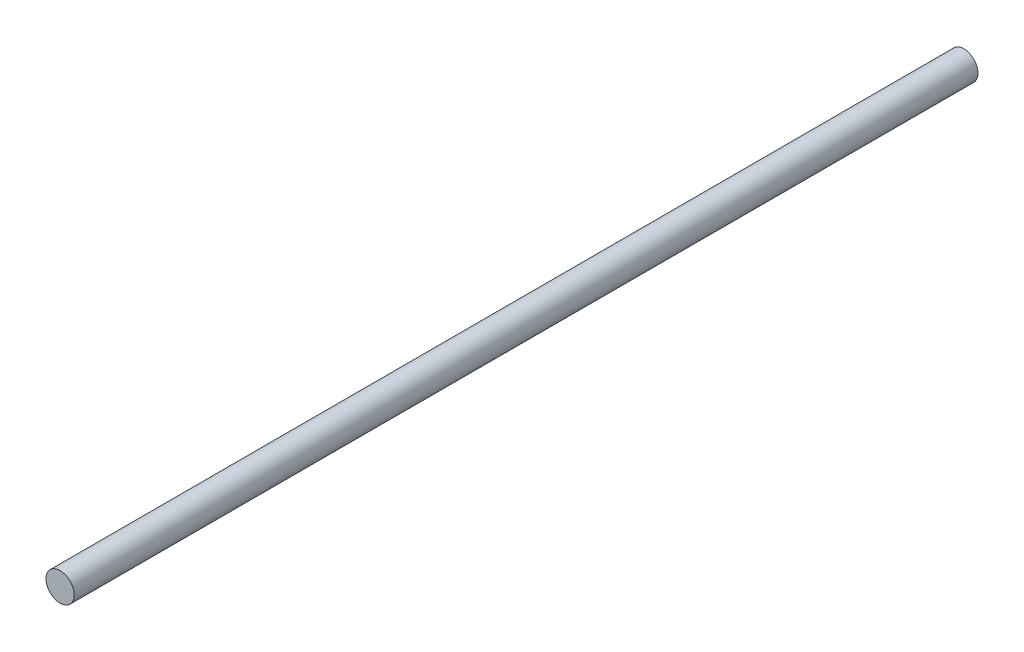
ISO-10303-21;
HEADER;
FILE_DESCRIPTION(('STEP AP214'),'2;1');
FILE_NAME('part.step','',(''),(''),'','','');
FILE_SCHEMA(('AUTOMOTIVE_DESIGN { 1 0 10303 214 1 1 1 1 }'));
ENDSEC;
DATA;
#1=APPLICATION_CONTEXT('core data for automotive mechanical design processes');
#2=APPLICATION_PROTOCOL_DEFINITION('international standard','automotive_design',2000,#1);
#3=PRODUCT_CONTEXT('',#1,'mechanical');
#4=PRODUCT('Part','Part','',(#3));
#5=PRODUCT_RELATED_PRODUCT_CATEGORY('part','',(#4));
#6=PRODUCT_DEFINITION_FORMATION('','',#4);
#7=PRODUCT_DEFINITION_CONTEXT('part definition',#1,'design');
#8=PRODUCT_DEFINITION('design','',#6,#7);
#9=PRODUCT_DEFINITION_SHAPE('','',#8);
#10=(LENGTH_UNIT() NAMED_UNIT(*) SI_UNIT(.MILLI.,.METRE.));
#11=(NAMED_UNIT(*) PLANE_ANGLE_UNIT() SI_UNIT($,.RADIAN.));
#12=(NAMED_UNIT(*) SI_UNIT($,.STERADIAN.) SOLID_ANGLE_UNIT());
#13=UNCERTAINTY_MEASURE_WITH_UNIT(LENGTH_MEASURE(1.E-05),#10,'distance_accuracy_value','');
#14=(GEOMETRIC_REPRESENTATION_CONTEXT(3) GLOBAL_UNCERTAINTY_ASSIGNED_CONTEXT((#13)) GLOBAL_UNIT_ASSIGNED_CONTEXT((#10,
#11,#12)) REPRESENTATION_CONTEXT('',''));
#15=CARTESIAN_POINT('',(0.,0.,0.));
#16=DIRECTION('',(0.,0.,1.));
#17=DIRECTION('',(1.,0.,0.));
#18=AXIS2_PLACEMENT_3D('',#15,#16,#17);
#19=CARTESIAN_POINT('',(0.,0.,203.2));
#20=DIRECTION('',(0.,0.,-1.));
#21=DIRECTION('',(-1.,0.,0.));
#22=AXIS2_PLACEMENT_3D('',#19,#20,#21);
#23=CYLINDRICAL_SURFACE('',#22,3.175);
#24=CARTESIAN_POINT('',(0.,0.,203.2));
#25=DIRECTION('',(0.,0.,1.));
#26=DIRECTION('',(1.,0.,0.));
#27=AXIS2_PLACEMENT_3D('',#24,#25,#26);
#28=CIRCLE('',#27,3.175);
#29=CARTESIAN_POINT('',(3.175,0.,203.2));
#30=VERTEX_POINT('',#29);
#31=EDGE_CURVE('E10',#30,#30,#28,.T.);
#32=ORIENTED_EDGE('',*,*,#31,.F.);
#33=EDGE_LOOP('',(#32));
#34=FACE_BOUND('',#33,.T.);
#35=CARTESIAN_POINT('',(0.,0.,0.));
#36=DIRECTION('',(0.,0.,1.));
#37=DIRECTION('',(1.,0.,0.));
#38=AXIS2_PLACEMENT_3D('',#35,#36,#37);
#39=CIRCLE('',#38,3.175);
#40=CARTESIAN_POINT('',(3.175,0.,0.));
#41=VERTEX_POINT('',#40);
#42=EDGE_CURVE('E34',#41,#41,#39,.T.);
#43=ORIENTED_EDGE('',*,*,#42,.T.);
#44=EDGE_LOOP('',(#43));
#45=FACE_BOUND('',#44,.T.);
#46=ADVANCED_FACE('F31',(#34,#45),#23,.T.);
#47=CARTESIAN_POINT('',(0.,0.,203.2));
#48=DIRECTION('',(0.,0.,1.));
#49=DIRECTION('',(1.,0.,0.));
#50=AXIS2_PLACEMENT_3D('',#47,#48,#49);
#51=PLANE('',#50);
#52=ORIENTED_EDGE('',*,*,#31,.T.);
#53=EDGE_LOOP('',(#52));
#54=FACE_BOUND('',#53,.T.);
#55=ADVANCED_FACE('F46',(#54),#51,.T.);
#56=CARTESIAN_POINT('',(0.,0.,0.));
#57=DIRECTION('',(0.,0.,1.));
#58=DIRECTION('',(1.,0.,0.));
#59=AXIS2_PLACEMENT_3D('',#56,#57,#58);
#60=PLANE('',#59);
#61=ORIENTED_EDGE('',*,*,#42,.F.);
#62=EDGE_LOOP('',(#61));
#63=FACE_BOUND('',#62,.T.);
#64=ADVANCED_FACE('F44',(#63),#60,.F.);
#65=CLOSED_SHELL('',(#46,#55,#64));
#66=MANIFOLD_SOLID_BREP('B2',#65);
#67=ADVANCED_BREP_SHAPE_REPRESENTATION('',(#18,#66),#14);
#68=SHAPE_DEFINITION_REPRESENTATION(#9,#67);
ENDSEC;
END-ISO-10303-21;
